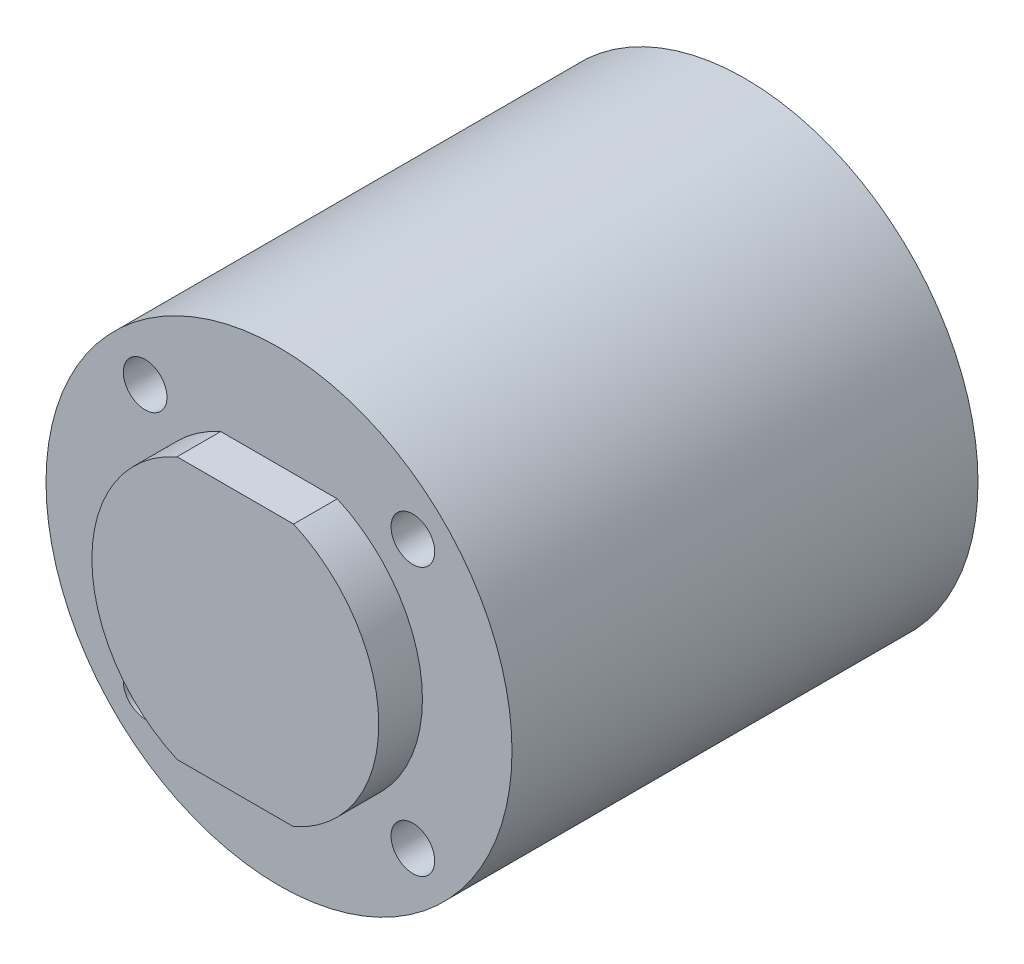
ISO-10303-21;
HEADER;
FILE_DESCRIPTION(('STEP AP214'),'2;1');
FILE_NAME('part.step','',(''),(''),'','','');
FILE_SCHEMA(('AUTOMOTIVE_DESIGN { 1 0 10303 214 1 1 1 1 }'));
ENDSEC;
DATA;
#1=APPLICATION_CONTEXT('core data for automotive mechanical design processes');
#2=APPLICATION_PROTOCOL_DEFINITION('international standard','automotive_design',2000,#1);
#3=PRODUCT_CONTEXT('',#1,'mechanical');
#4=PRODUCT('Part','Part','',(#3));
#5=PRODUCT_RELATED_PRODUCT_CATEGORY('part','',(#4));
#6=PRODUCT_DEFINITION_FORMATION('','',#4);
#7=PRODUCT_DEFINITION_CONTEXT('part definition',#1,'design');
#8=PRODUCT_DEFINITION('design','',#6,#7);
#9=PRODUCT_DEFINITION_SHAPE('','',#8);
#10=(LENGTH_UNIT() NAMED_UNIT(*) SI_UNIT(.MILLI.,.METRE.));
#11=(NAMED_UNIT(*) PLANE_ANGLE_UNIT() SI_UNIT($,.RADIAN.));
#12=(NAMED_UNIT(*) SI_UNIT($,.STERADIAN.) SOLID_ANGLE_UNIT());
#13=UNCERTAINTY_MEASURE_WITH_UNIT(LENGTH_MEASURE(1.E-05),#10,'distance_accuracy_value','');
#14=(GEOMETRIC_REPRESENTATION_CONTEXT(3) GLOBAL_UNCERTAINTY_ASSIGNED_CONTEXT((#13)) GLOBAL_UNIT_ASSIGNED_CONTEXT((#10,
#11,#12)) REPRESENTATION_CONTEXT('',''));
#15=CARTESIAN_POINT('',(0.,0.,0.));
#16=DIRECTION('',(0.,0.,1.));
#17=DIRECTION('',(1.,0.,0.));
#18=AXIS2_PLACEMENT_3D('',#15,#16,#17);
#19=CARTESIAN_POINT('',(0.,0.,3.));
#20=DIRECTION('',(0.,0.,-1.));
#21=DIRECTION('',(-1.,0.,0.));
#22=AXIS2_PLACEMENT_3D('',#19,#20,#21);
#23=CYLINDRICAL_SURFACE('',#22,9.85);
#24=CARTESIAN_POINT('',(0.,0.,0.));
#25=DIRECTION('',(0.,0.,1.));
#26=DIRECTION('',(1.,0.,0.));
#27=AXIS2_PLACEMENT_3D('',#24,#25,#26);
#28=CIRCLE('',#27,9.85);
#29=CARTESIAN_POINT('',(-4.00281151192509,9.,0.));
#30=VERTEX_POINT('',#29);
#31=CARTESIAN_POINT('',(-4.00281151192509,-9.,0.));
#32=VERTEX_POINT('',#31);
#33=EDGE_CURVE('E74',#30,#32,#28,.T.);
#34=ORIENTED_EDGE('',*,*,#33,.T.);
#35=DIRECTION('',(0.,0.,-1.));
#36=VECTOR('',#35,1.);
#37=CARTESIAN_POINT('',(-4.00281151192509,-9.,3.));
#38=LINE('',#37,#36);
#39=CARTESIAN_POINT('',(-4.00281151192509,-9.,3.));
#40=VERTEX_POINT('',#39);
#41=EDGE_CURVE('E11',#40,#32,#38,.T.);
#42=ORIENTED_EDGE('',*,*,#41,.F.);
#43=CARTESIAN_POINT('',(0.,0.,3.));
#44=DIRECTION('',(0.,0.,1.));
#45=DIRECTION('',(1.,0.,0.));
#46=AXIS2_PLACEMENT_3D('',#43,#44,#45);
#47=CIRCLE('',#46,9.85);
#48=CARTESIAN_POINT('',(-4.00281151192509,9.,3.));
#49=VERTEX_POINT('',#48);
#50=EDGE_CURVE('E100',#49,#40,#47,.T.);
#51=ORIENTED_EDGE('',*,*,#50,.F.);
#52=DIRECTION('',(0.,0.,-1.));
#53=VECTOR('',#52,1.);
#54=CARTESIAN_POINT('',(-4.00281151192509,9.,3.));
#55=LINE('',#54,#53);
#56=EDGE_CURVE('E88',#49,#30,#55,.T.);
#57=ORIENTED_EDGE('',*,*,#56,.T.);
#58=EDGE_LOOP('',(#34,#42,#51,#57));
#59=FACE_BOUND('',#58,.T.);
#60=ADVANCED_FACE('F34',(#59),#23,.T.);
#61=CARTESIAN_POINT('',(-4.00281151192509,-9.,3.));
#62=DIRECTION('',(0.,1.,0.));
#63=DIRECTION('',(-1.,0.,0.));
#64=AXIS2_PLACEMENT_3D('',#61,#62,#63);
#65=PLANE('',#64);
#66=DIRECTION('',(1.,0.,0.));
#67=VECTOR('',#66,1.);
#68=CARTESIAN_POINT('',(-4.00281151192509,-9.,0.));
#69=LINE('',#68,#67);
#70=CARTESIAN_POINT('',(4.00281151192509,-9.,0.));
#71=VERTEX_POINT('',#70);
#72=EDGE_CURVE('E70',#32,#71,#69,.T.);
#73=ORIENTED_EDGE('',*,*,#72,.T.);
#74=DIRECTION('',(0.,0.,-1.));
#75=VECTOR('',#74,1.);
#76=CARTESIAN_POINT('',(4.00281151192509,-9.,3.));
#77=LINE('',#76,#75);
#78=CARTESIAN_POINT('',(4.00281151192509,-9.,3.));
#79=VERTEX_POINT('',#78);
#80=EDGE_CURVE('E42',#79,#71,#77,.T.);
#81=ORIENTED_EDGE('',*,*,#80,.F.);
#82=DIRECTION('',(1.,0.,0.));
#83=VECTOR('',#82,1.);
#84=CARTESIAN_POINT('',(-4.00281151192509,-9.,3.));
#85=LINE('',#84,#83);
#86=EDGE_CURVE('E84',#40,#79,#85,.T.);
#87=ORIENTED_EDGE('',*,*,#86,.F.);
#88=ORIENTED_EDGE('',*,*,#41,.T.);
#89=EDGE_LOOP('',(#73,#81,#87,#88));
#90=FACE_BOUND('',#89,.T.);
#91=ADVANCED_FACE('F83',(#90),#65,.F.);
#92=CARTESIAN_POINT('',(0.,0.,3.));
#93=DIRECTION('',(0.,0.,-1.));
#94=DIRECTION('',(-1.,0.,0.));
#95=AXIS2_PLACEMENT_3D('',#92,#93,#94);
#96=CYLINDRICAL_SURFACE('',#95,9.85);
#97=CARTESIAN_POINT('',(0.,0.,0.));
#98=DIRECTION('',(0.,0.,1.));
#99=DIRECTION('',(1.,0.,0.));
#100=AXIS2_PLACEMENT_3D('',#97,#98,#99);
#101=CIRCLE('',#100,9.85);
#102=CARTESIAN_POINT('',(4.00281151192509,9.,0.));
#103=VERTEX_POINT('',#102);
#104=EDGE_CURVE('E77',#71,#103,#101,.T.);
#105=ORIENTED_EDGE('',*,*,#104,.T.);
#106=DIRECTION('',(0.,0.,-1.));
#107=VECTOR('',#106,1.);
#108=CARTESIAN_POINT('',(4.00281151192509,9.,3.));
#109=LINE('',#108,#107);
#110=CARTESIAN_POINT('',(4.00281151192509,9.,3.));
#111=VERTEX_POINT('',#110);
#112=EDGE_CURVE('E102',#111,#103,#109,.T.);
#113=ORIENTED_EDGE('',*,*,#112,.F.);
#114=CARTESIAN_POINT('',(0.,0.,3.));
#115=DIRECTION('',(0.,0.,1.));
#116=DIRECTION('',(1.,0.,0.));
#117=AXIS2_PLACEMENT_3D('',#114,#115,#116);
#118=CIRCLE('',#117,9.85);
#119=EDGE_CURVE('E108',#79,#111,#118,.T.);
#120=ORIENTED_EDGE('',*,*,#119,.F.);
#121=ORIENTED_EDGE('',*,*,#80,.T.);
#122=EDGE_LOOP('',(#105,#113,#120,#121));
#123=FACE_BOUND('',#122,.T.);
#124=ADVANCED_FACE('F106',(#123),#96,.T.);
#125=CARTESIAN_POINT('',(-4.00281151192509,9.,3.));
#126=DIRECTION('',(0.,-1.,0.));
#127=DIRECTION('',(1.,0.,0.));
#128=AXIS2_PLACEMENT_3D('',#125,#126,#127);
#129=PLANE('',#128);
#130=DIRECTION('',(-1.,0.,0.));
#131=VECTOR('',#130,1.);
#132=CARTESIAN_POINT('',(-4.00281151192509,9.,0.));
#133=LINE('',#132,#131);
#134=EDGE_CURVE('E98',#103,#30,#133,.T.);
#135=ORIENTED_EDGE('',*,*,#134,.T.);
#136=ORIENTED_EDGE('',*,*,#56,.F.);
#137=DIRECTION('',(-1.,0.,0.));
#138=VECTOR('',#137,1.);
#139=CARTESIAN_POINT('',(-4.00281151192509,9.,3.));
#140=LINE('',#139,#138);
#141=EDGE_CURVE('E49',#111,#49,#140,.T.);
#142=ORIENTED_EDGE('',*,*,#141,.F.);
#143=ORIENTED_EDGE('',*,*,#112,.T.);
#144=EDGE_LOOP('',(#135,#136,#142,#143));
#145=FACE_BOUND('',#144,.T.);
#146=ADVANCED_FACE('F167',(#145),#129,.F.);
#147=CARTESIAN_POINT('',(0.,0.,3.));
#148=DIRECTION('',(0.,0.,1.));
#149=DIRECTION('',(1.,0.,0.));
#150=AXIS2_PLACEMENT_3D('',#147,#148,#149);
#151=PLANE('',#150);
#152=ORIENTED_EDGE('',*,*,#50,.T.);
#153=ORIENTED_EDGE('',*,*,#86,.T.);
#154=ORIENTED_EDGE('',*,*,#119,.T.);
#155=ORIENTED_EDGE('',*,*,#141,.T.);
#156=EDGE_LOOP('',(#152,#153,#154,#155));
#157=FACE_BOUND('',#156,.T.);
#158=ADVANCED_FACE('F172',(#157),#151,.T.);
#159=CARTESIAN_POINT('',(0.,0.,-32.));
#160=DIRECTION('',(0.,0.,1.));
#161=DIRECTION('',(1.,0.,0.));
#162=AXIS2_PLACEMENT_3D('',#159,#160,#161);
#163=CYLINDRICAL_SURFACE('',#162,16.);
#164=CARTESIAN_POINT('',(0.,0.,-32.));
#165=DIRECTION('',(0.,0.,-1.));
#166=DIRECTION('',(-1.,0.,0.));
#167=AXIS2_PLACEMENT_3D('',#164,#165,#166);
#168=CIRCLE('',#167,16.);
#169=CARTESIAN_POINT('',(-16.,0.,-32.));
#170=VERTEX_POINT('',#169);
#171=EDGE_CURVE('E89',#170,#170,#168,.T.);
#172=ORIENTED_EDGE('',*,*,#171,.F.);
#173=EDGE_LOOP('',(#172));
#174=FACE_BOUND('',#173,.T.);
#175=CARTESIAN_POINT('',(0.,0.,0.));
#176=DIRECTION('',(0.,0.,-1.));
#177=DIRECTION('',(-1.,0.,0.));
#178=AXIS2_PLACEMENT_3D('',#175,#176,#177);
#179=CIRCLE('',#178,16.);
#180=CARTESIAN_POINT('',(-16.,0.,0.));
#181=VERTEX_POINT('',#180);
#182=EDGE_CURVE('E92',#181,#181,#179,.T.);
#183=ORIENTED_EDGE('',*,*,#182,.T.);
#184=EDGE_LOOP('',(#183));
#185=FACE_BOUND('',#184,.T.);
#186=ADVANCED_FACE('F176',(#174,#185),#163,.T.);
#187=CARTESIAN_POINT('',(0.,0.,-32.));
#188=DIRECTION('',(0.,0.,-1.));
#189=DIRECTION('',(-1.,0.,0.));
#190=AXIS2_PLACEMENT_3D('',#187,#188,#189);
#191=PLANE('',#190);
#192=ORIENTED_EDGE('',*,*,#171,.T.);
#193=EDGE_LOOP('',(#192));
#194=FACE_BOUND('',#193,.T.);
#195=ADVANCED_FACE('F144',(#194),#191,.T.);
#196=CARTESIAN_POINT('',(0.,0.,0.));
#197=DIRECTION('',(0.,0.,-1.));
#198=DIRECTION('',(-1.,0.,0.));
#199=AXIS2_PLACEMENT_3D('',#196,#197,#198);
#200=PLANE('',#199);
#201=CARTESIAN_POINT('',(9.19238815542568,-9.19238815542455,0.));
#202=DIRECTION('',(0.,0.,1.));
#203=DIRECTION('',(1.,0.,0.));
#204=AXIS2_PLACEMENT_3D('',#201,#202,#203);
#205=CIRCLE('',#204,1.50000000000072);
#206=CARTESIAN_POINT('',(10.6923881554264,-9.19238815542455,0.));
#207=VERTEX_POINT('',#206);
#208=EDGE_CURVE('E124',#207,#207,#205,.T.);
#209=ORIENTED_EDGE('',*,*,#208,.F.);
#210=EDGE_LOOP('',(#209));
#211=FACE_BOUND('',#210,.T.);
#212=CARTESIAN_POINT('',(-9.19238815542455,-9.19238815542517,0.));
#213=DIRECTION('',(0.,0.,1.));
#214=DIRECTION('',(1.,0.,0.));
#215=AXIS2_PLACEMENT_3D('',#212,#213,#214);
#216=CIRCLE('',#215,1.50000000000027);
#217=CARTESIAN_POINT('',(-7.69238815542427,-9.19238815542517,0.));
#218=VERTEX_POINT('',#217);
#219=EDGE_CURVE('E130',#218,#218,#216,.T.);
#220=ORIENTED_EDGE('',*,*,#219,.F.);
#221=EDGE_LOOP('',(#220));
#222=FACE_BOUND('',#221,.T.);
#223=CARTESIAN_POINT('',(-9.19238815542517,9.19238815542507,0.));
#224=DIRECTION('',(0.,0.,1.));
#225=DIRECTION('',(1.,0.,0.));
#226=AXIS2_PLACEMENT_3D('',#223,#224,#225);
#227=CIRCLE('',#226,1.5);
#228=CARTESIAN_POINT('',(-7.69238815542517,9.19238815542507,0.));
#229=VERTEX_POINT('',#228);
#230=EDGE_CURVE('E118',#229,#229,#227,.T.);
#231=ORIENTED_EDGE('',*,*,#230,.F.);
#232=EDGE_LOOP('',(#231));
#233=FACE_BOUND('',#232,.T.);
#234=CARTESIAN_POINT('',(9.19238815542507,9.19238815542568,0.));
#235=DIRECTION('',(0.,0.,1.));
#236=DIRECTION('',(1.,0.,0.));
#237=AXIS2_PLACEMENT_3D('',#234,#235,#236);
#238=CIRCLE('',#237,1.50000000000053);
#239=CARTESIAN_POINT('',(10.6923881554256,9.19238815542568,0.));
#240=VERTEX_POINT('',#239);
#241=EDGE_CURVE('E115',#240,#240,#238,.T.);
#242=ORIENTED_EDGE('',*,*,#241,.F.);
#243=EDGE_LOOP('',(#242));
#244=FACE_BOUND('',#243,.T.);
#245=ORIENTED_EDGE('',*,*,#33,.F.);
#246=ORIENTED_EDGE('',*,*,#134,.F.);
#247=ORIENTED_EDGE('',*,*,#104,.F.);
#248=ORIENTED_EDGE('',*,*,#72,.F.);
#249=EDGE_LOOP('',(#245,#246,#247,#248));
#250=FACE_BOUND('',#249,.T.);
#251=ORIENTED_EDGE('',*,*,#182,.F.);
#252=EDGE_LOOP('',(#251));
#253=FACE_BOUND('',#252,.T.);
#254=ADVANCED_FACE('F71',(#211,#222,#233,#244,#250,#253),#200,.F.);
#255=CARTESIAN_POINT('',(9.19238815542507,9.19238815542568,-10.));
#256=DIRECTION('',(0.,0.,1.));
#257=DIRECTION('',(1.,0.,0.));
#258=AXIS2_PLACEMENT_3D('',#255,#256,#257);
#259=CYLINDRICAL_SURFACE('',#258,1.50000000000053);
#260=CARTESIAN_POINT('',(9.19238815542507,9.19238815542568,-10.));
#261=DIRECTION('',(0.,0.,1.));
#262=DIRECTION('',(1.,0.,0.));
#263=AXIS2_PLACEMENT_3D('',#260,#261,#262);
#264=CIRCLE('',#263,1.50000000000053);
#265=CARTESIAN_POINT('',(10.6923881554256,9.19238815542568,-10.));
#266=VERTEX_POINT('',#265);
#267=EDGE_CURVE('E113',#266,#266,#264,.T.);
#268=ORIENTED_EDGE('',*,*,#267,.F.);
#269=EDGE_LOOP('',(#268));
#270=FACE_BOUND('',#269,.T.);
#271=ORIENTED_EDGE('',*,*,#241,.T.);
#272=EDGE_LOOP('',(#271));
#273=FACE_BOUND('',#272,.T.);
#274=ADVANCED_FACE('F143',(#270,#273),#259,.F.);
#275=CARTESIAN_POINT('',(9.19238815542507,9.19238815542568,-10.));
#276=DIRECTION('',(0.,0.,1.));
#277=DIRECTION('',(1.,0.,0.));
#278=AXIS2_PLACEMENT_3D('',#275,#276,#277);
#279=PLANE('',#278);
#280=ORIENTED_EDGE('',*,*,#267,.T.);
#281=EDGE_LOOP('',(#280));
#282=FACE_BOUND('',#281,.T.);
#283=ADVANCED_FACE('F150',(#282),#279,.T.);
#284=CARTESIAN_POINT('',(-9.19238815542517,9.19238815542507,-10.));
#285=DIRECTION('',(0.,0.,1.));
#286=DIRECTION('',(1.,0.,0.));
#287=AXIS2_PLACEMENT_3D('',#284,#285,#286);
#288=CYLINDRICAL_SURFACE('',#287,1.5);
#289=CARTESIAN_POINT('',(-9.19238815542517,9.19238815542507,-10.));
#290=DIRECTION('',(0.,0.,1.));
#291=DIRECTION('',(1.,0.,0.));
#292=AXIS2_PLACEMENT_3D('',#289,#290,#291);
#293=CIRCLE('',#292,1.5);
#294=CARTESIAN_POINT('',(-7.69238815542517,9.19238815542507,-10.));
#295=VERTEX_POINT('',#294);
#296=EDGE_CURVE('E133',#295,#295,#293,.T.);
#297=ORIENTED_EDGE('',*,*,#296,.F.);
#298=EDGE_LOOP('',(#297));
#299=FACE_BOUND('',#298,.T.);
#300=ORIENTED_EDGE('',*,*,#230,.T.);
#301=EDGE_LOOP('',(#300));
#302=FACE_BOUND('',#301,.T.);
#303=ADVANCED_FACE('F139',(#299,#302),#288,.F.);
#304=CARTESIAN_POINT('',(-9.19238815542517,9.19238815542507,-10.));
#305=DIRECTION('',(0.,0.,1.));
#306=DIRECTION('',(1.,0.,0.));
#307=AXIS2_PLACEMENT_3D('',#304,#305,#306);
#308=PLANE('',#307);
#309=ORIENTED_EDGE('',*,*,#296,.T.);
#310=EDGE_LOOP('',(#309));
#311=FACE_BOUND('',#310,.T.);
#312=ADVANCED_FACE('F211',(#311),#308,.T.);
#313=CARTESIAN_POINT('',(-9.19238815542455,-9.19238815542517,-10.));
#314=DIRECTION('',(0.,0.,1.));
#315=DIRECTION('',(1.,0.,0.));
#316=AXIS2_PLACEMENT_3D('',#313,#314,#315);
#317=CYLINDRICAL_SURFACE('',#316,1.50000000000027);
#318=CARTESIAN_POINT('',(-9.19238815542455,-9.19238815542517,-10.));
#319=DIRECTION('',(0.,0.,1.));
#320=DIRECTION('',(1.,0.,0.));
#321=AXIS2_PLACEMENT_3D('',#318,#319,#320);
#322=CIRCLE('',#321,1.50000000000027);
#323=CARTESIAN_POINT('',(-7.69238815542427,-9.19238815542517,-10.));
#324=VERTEX_POINT('',#323);
#325=EDGE_CURVE('E127',#324,#324,#322,.T.);
#326=ORIENTED_EDGE('',*,*,#325,.F.);
#327=EDGE_LOOP('',(#326));
#328=FACE_BOUND('',#327,.T.);
#329=ORIENTED_EDGE('',*,*,#219,.T.);
#330=EDGE_LOOP('',(#329));
#331=FACE_BOUND('',#330,.T.);
#332=ADVANCED_FACE('F221',(#328,#331),#317,.F.);
#333=CARTESIAN_POINT('',(-9.19238815542455,-9.19238815542517,-10.));
#334=DIRECTION('',(0.,0.,1.));
#335=DIRECTION('',(1.,0.,0.));
#336=AXIS2_PLACEMENT_3D('',#333,#334,#335);
#337=PLANE('',#336);
#338=ORIENTED_EDGE('',*,*,#325,.T.);
#339=EDGE_LOOP('',(#338));
#340=FACE_BOUND('',#339,.T.);
#341=ADVANCED_FACE('F231',(#340),#337,.T.);
#342=CARTESIAN_POINT('',(9.19238815542568,-9.19238815542455,-10.));
#343=DIRECTION('',(0.,0.,1.));
#344=DIRECTION('',(1.,0.,0.));
#345=AXIS2_PLACEMENT_3D('',#342,#343,#344);
#346=CYLINDRICAL_SURFACE('',#345,1.50000000000072);
#347=CARTESIAN_POINT('',(9.19238815542568,-9.19238815542455,-10.));
#348=DIRECTION('',(0.,0.,1.));
#349=DIRECTION('',(1.,0.,0.));
#350=AXIS2_PLACEMENT_3D('',#347,#348,#349);
#351=CIRCLE('',#350,1.50000000000072);
#352=CARTESIAN_POINT('',(10.6923881554264,-9.19238815542455,-10.));
#353=VERTEX_POINT('',#352);
#354=EDGE_CURVE('E121',#353,#353,#351,.T.);
#355=ORIENTED_EDGE('',*,*,#354,.F.);
#356=EDGE_LOOP('',(#355));
#357=FACE_BOUND('',#356,.T.);
#358=ORIENTED_EDGE('',*,*,#208,.T.);
#359=EDGE_LOOP('',(#358));
#360=FACE_BOUND('',#359,.T.);
#361=ADVANCED_FACE('F241',(#357,#360),#346,.F.);
#362=CARTESIAN_POINT('',(9.19238815542568,-9.19238815542455,-10.));
#363=DIRECTION('',(0.,0.,1.));
#364=DIRECTION('',(1.,0.,0.));
#365=AXIS2_PLACEMENT_3D('',#362,#363,#364);
#366=PLANE('',#365);
#367=ORIENTED_EDGE('',*,*,#354,.T.);
#368=EDGE_LOOP('',(#367));
#369=FACE_BOUND('',#368,.T.);
#370=ADVANCED_FACE('F251',(#369),#366,.T.);
#371=CLOSED_SHELL('',(#60,#91,#124,#146,#158,#186,#195,#254,#274,#283,#303,#312,#332,#341,#361,#370));
#372=MANIFOLD_SOLID_BREP('B2',#371);
#373=ADVANCED_BREP_SHAPE_REPRESENTATION('',(#18,#372),#14);
#374=SHAPE_DEFINITION_REPRESENTATION(#9,#373);
ENDSEC;
END-ISO-10303-21;
